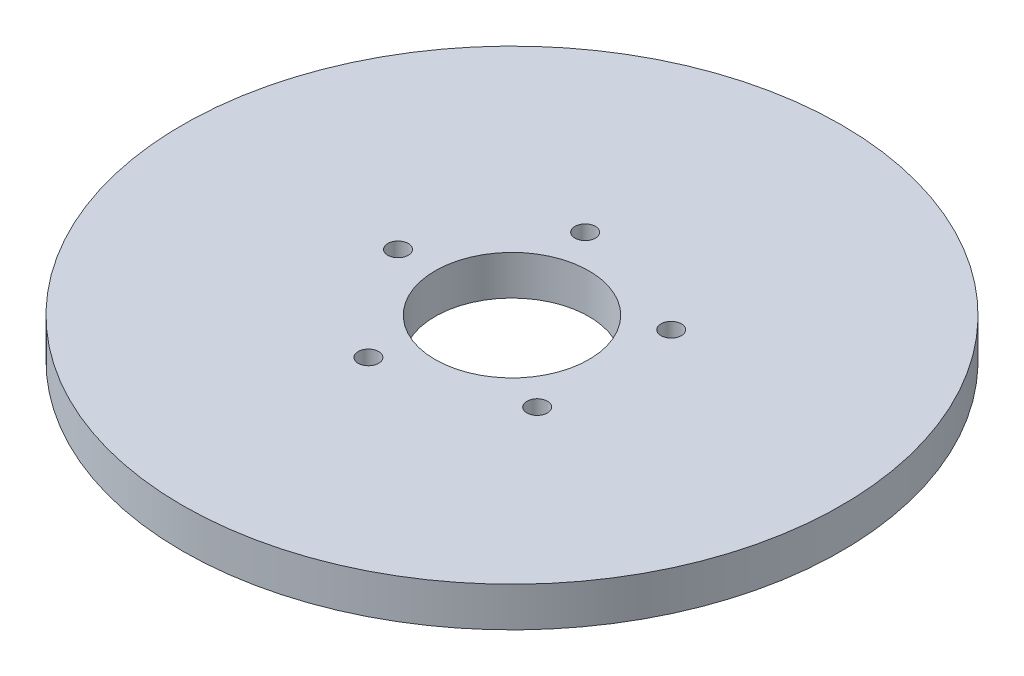
ISO-10303-21;
HEADER;
FILE_DESCRIPTION(('STEP AP214'),'2;1');
FILE_NAME('part.step','',(''),(''),'','','');
FILE_SCHEMA(('AUTOMOTIVE_DESIGN { 1 0 10303 214 1 1 1 1 }'));
ENDSEC;
DATA;
#1=APPLICATION_CONTEXT('core data for automotive mechanical design processes');
#2=APPLICATION_PROTOCOL_DEFINITION('international standard','automotive_design',2000,#1);
#3=PRODUCT_CONTEXT('',#1,'mechanical');
#4=PRODUCT('Part','Part','',(#3));
#5=PRODUCT_RELATED_PRODUCT_CATEGORY('part','',(#4));
#6=PRODUCT_DEFINITION_FORMATION('','',#4);
#7=PRODUCT_DEFINITION_CONTEXT('part definition',#1,'design');
#8=PRODUCT_DEFINITION('design','',#6,#7);
#9=PRODUCT_DEFINITION_SHAPE('','',#8);
#10=(LENGTH_UNIT() NAMED_UNIT(*) SI_UNIT(.MILLI.,.METRE.));
#11=(NAMED_UNIT(*) PLANE_ANGLE_UNIT() SI_UNIT($,.RADIAN.));
#12=(NAMED_UNIT(*) SI_UNIT($,.STERADIAN.) SOLID_ANGLE_UNIT());
#13=UNCERTAINTY_MEASURE_WITH_UNIT(LENGTH_MEASURE(1.E-05),#10,'distance_accuracy_value','');
#14=(GEOMETRIC_REPRESENTATION_CONTEXT(3) GLOBAL_UNCERTAINTY_ASSIGNED_CONTEXT((#13)) GLOBAL_UNIT_ASSIGNED_CONTEXT((#10,
#11,#12)) REPRESENTATION_CONTEXT('',''));
#15=CARTESIAN_POINT('',(0.,0.,0.));
#16=DIRECTION('',(0.,0.,1.));
#17=DIRECTION('',(1.,0.,0.));
#18=AXIS2_PLACEMENT_3D('',#15,#16,#17);
#19=CARTESIAN_POINT('',(0.,9.,0.));
#20=DIRECTION('',(0.,-1.,0.));
#21=DIRECTION('',(0.,0.,-1.));
#22=AXIS2_PLACEMENT_3D('',#19,#20,#21);
#23=CYLINDRICAL_SURFACE('',#22,75.);
#24=CARTESIAN_POINT('',(0.,9.,0.));
#25=DIRECTION('',(0.,1.,0.));
#26=DIRECTION('',(0.,0.,1.));
#27=AXIS2_PLACEMENT_3D('',#24,#25,#26);
#28=CIRCLE('',#27,75.);
#29=CARTESIAN_POINT('',(0.,9.,75.));
#30=VERTEX_POINT('',#29);
#31=EDGE_CURVE('E10',#30,#30,#28,.T.);
#32=ORIENTED_EDGE('',*,*,#31,.F.);
#33=EDGE_LOOP('',(#32));
#34=FACE_BOUND('',#33,.T.);
#35=CARTESIAN_POINT('',(0.,0.,0.));
#36=DIRECTION('',(0.,1.,0.));
#37=DIRECTION('',(0.,0.,1.));
#38=AXIS2_PLACEMENT_3D('',#35,#36,#37);
#39=CIRCLE('',#38,75.);
#40=CARTESIAN_POINT('',(0.,0.,75.));
#41=VERTEX_POINT('',#40);
#42=EDGE_CURVE('E37',#41,#41,#39,.T.);
#43=ORIENTED_EDGE('',*,*,#42,.T.);
#44=EDGE_LOOP('',(#43));
#45=FACE_BOUND('',#44,.T.);
#46=ADVANCED_FACE('F40',(#34,#45),#23,.T.);
#47=CARTESIAN_POINT('',(0.,9.,0.));
#48=DIRECTION('',(0.,1.,0.));
#49=DIRECTION('',(0.,0.,1.));
#50=AXIS2_PLACEMENT_3D('',#47,#48,#49);
#51=PLANE('',#50);
#52=CARTESIAN_POINT('',(-8.01522008981041,9.,24.6683109172461));
#53=DIRECTION('',(0.,1.,0.));
#54=DIRECTION('',(0.951056516295155,0.,0.309016994374945));
#55=AXIS2_PLACEMENT_3D('',#52,#53,#54);
#56=CIRCLE('',#55,2.33240991265965);
#57=CARTESIAN_POINT('',(-5.79696644370404,9.,25.3890652181065));
#58=VERTEX_POINT('',#57);
#59=EDGE_CURVE('E78',#58,#58,#56,.T.);
#60=ORIENTED_EDGE('',*,*,#59,.F.);
#61=EDGE_LOOP('',(#60));
#62=FACE_BOUND('',#61,.T.);
#63=CARTESIAN_POINT('',(20.9841186224349,9.,15.2458545919081));
#64=DIRECTION('',(0.,1.,0.));
#65=DIRECTION('',(0.587785252292469,0.,-0.809016994374951));
#66=AXIS2_PLACEMENT_3D('',#63,#64,#65);
#67=CIRCLE('',#66,2.33240991265965);
#68=CARTESIAN_POINT('',(22.355074771397,9.,13.3588953347178));
#69=VERTEX_POINT('',#68);
#70=EDGE_CURVE('E71',#69,#69,#67,.T.);
#71=ORIENTED_EDGE('',*,*,#70,.F.);
#72=EDGE_LOOP('',(#71));
#73=FACE_BOUND('',#72,.T.);
#74=CARTESIAN_POINT('',(20.9841186224347,9.,-15.2458545919084));
#75=DIRECTION('',(0.,1.,0.));
#76=DIRECTION('',(-0.58778525229248,0.,-0.809016994374942));
#77=AXIS2_PLACEMENT_3D('',#74,#75,#76);
#78=CIRCLE('',#77,2.33240991265965);
#79=CARTESIAN_POINT('',(19.6131624734726,9.,-17.1328138490986));
#80=VERTEX_POINT('',#79);
#81=EDGE_CURVE('E70',#80,#80,#78,.T.);
#82=ORIENTED_EDGE('',*,*,#81,.F.);
#83=EDGE_LOOP('',(#82));
#84=FACE_BOUND('',#83,.T.);
#85=CARTESIAN_POINT('',(-8.01522008981076,9.,-24.668310917246));
#86=DIRECTION('',(0.,1.,0.));
#87=DIRECTION('',(-0.95105651629515,0.,0.309016994374958));
#88=AXIS2_PLACEMENT_3D('',#85,#86,#87);
#89=CIRCLE('',#88,2.33240991265965);
#90=CARTESIAN_POINT('',(-10.2334737359171,9.,-23.9475566163855));
#91=VERTEX_POINT('',#90);
#92=EDGE_CURVE('E61',#91,#91,#89,.T.);
#93=ORIENTED_EDGE('',*,*,#92,.F.);
#94=EDGE_LOOP('',(#93));
#95=FACE_BOUND('',#94,.T.);
#96=CARTESIAN_POINT('',(-25.9377970652487,9.,0.));
#97=DIRECTION('',(0.,1.,0.));
#98=DIRECTION('',(0.,0.,1.));
#99=AXIS2_PLACEMENT_3D('',#96,#97,#98);
#100=CIRCLE('',#99,2.33240991265965);
#101=CARTESIAN_POINT('',(-25.9377970652487,9.,2.33240991265965));
#102=VERTEX_POINT('',#101);
#103=EDGE_CURVE('E54',#102,#102,#100,.T.);
#104=ORIENTED_EDGE('',*,*,#103,.F.);
#105=EDGE_LOOP('',(#104));
#106=FACE_BOUND('',#105,.T.);
#107=CARTESIAN_POINT('',(0.,9.,0.));
#108=DIRECTION('',(0.,1.,0.));
#109=DIRECTION('',(0.,0.,1.));
#110=AXIS2_PLACEMENT_3D('',#107,#108,#109);
#111=CIRCLE('',#110,17.5);
#112=CARTESIAN_POINT('',(0.,9.,17.5));
#113=VERTEX_POINT('',#112);
#114=EDGE_CURVE('E50',#113,#113,#111,.T.);
#115=ORIENTED_EDGE('',*,*,#114,.F.);
#116=EDGE_LOOP('',(#115));
#117=FACE_BOUND('',#116,.T.);
#118=ORIENTED_EDGE('',*,*,#31,.T.);
#119=EDGE_LOOP('',(#118));
#120=FACE_BOUND('',#119,.T.);
#121=ADVANCED_FACE('F94',(#62,#73,#84,#95,#106,#117,#120),#51,.T.);
#122=CARTESIAN_POINT('',(0.,0.,0.));
#123=DIRECTION('',(0.,1.,0.));
#124=DIRECTION('',(0.,0.,1.));
#125=AXIS2_PLACEMENT_3D('',#122,#123,#124);
#126=PLANE('',#125);
#127=CARTESIAN_POINT('',(0.,0.,0.));
#128=DIRECTION('',(0.,1.,0.));
#129=DIRECTION('',(0.,0.,1.));
#130=AXIS2_PLACEMENT_3D('',#127,#128,#129);
#131=CIRCLE('',#130,17.5);
#132=CARTESIAN_POINT('',(0.,0.,17.5));
#133=VERTEX_POINT('',#132);
#134=EDGE_CURVE('E47',#133,#133,#131,.T.);
#135=ORIENTED_EDGE('',*,*,#134,.T.);
#136=EDGE_LOOP('',(#135));
#137=FACE_BOUND('',#136,.T.);
#138=ORIENTED_EDGE('',*,*,#42,.F.);
#139=EDGE_LOOP('',(#138));
#140=FACE_BOUND('',#139,.T.);
#141=ADVANCED_FACE('F100',(#137,#140),#126,.F.);
#142=CARTESIAN_POINT('',(0.,9.,0.));
#143=DIRECTION('',(0.,-1.,0.));
#144=DIRECTION('',(0.,0.,-1.));
#145=AXIS2_PLACEMENT_3D('',#142,#143,#144);
#146=CYLINDRICAL_SURFACE('',#145,17.5);
#147=ORIENTED_EDGE('',*,*,#114,.T.);
#148=EDGE_LOOP('',(#147));
#149=FACE_BOUND('',#148,.T.);
#150=ORIENTED_EDGE('',*,*,#134,.F.);
#151=EDGE_LOOP('',(#150));
#152=FACE_BOUND('',#151,.T.);
#153=ADVANCED_FACE('F108',(#149,#152),#146,.F.);
#154=CARTESIAN_POINT('',(-25.9377970652487,0.433587434508758,0.));
#155=DIRECTION('',(0.,1.,0.));
#156=DIRECTION('',(0.,0.,1.));
#157=AXIS2_PLACEMENT_3D('',#154,#155,#156);
#158=CYLINDRICAL_SURFACE('',#157,2.33240991265965);
#159=CARTESIAN_POINT('',(-25.9377970652487,0.433587434508758,0.));
#160=DIRECTION('',(0.,1.,0.));
#161=DIRECTION('',(0.,0.,1.));
#162=AXIS2_PLACEMENT_3D('',#159,#160,#161);
#163=CIRCLE('',#162,2.33240991265965);
#164=CARTESIAN_POINT('',(-25.9377970652487,0.433587434508758,2.33240991265965));
#165=VERTEX_POINT('',#164);
#166=EDGE_CURVE('E55',#165,#165,#163,.T.);
#167=ORIENTED_EDGE('',*,*,#166,.F.);
#168=EDGE_LOOP('',(#167));
#169=FACE_BOUND('',#168,.T.);
#170=ORIENTED_EDGE('',*,*,#103,.T.);
#171=EDGE_LOOP('',(#170));
#172=FACE_BOUND('',#171,.T.);
#173=ADVANCED_FACE('F115',(#169,#172),#158,.F.);
#174=CARTESIAN_POINT('',(-25.9377970652487,0.433587434508758,0.));
#175=DIRECTION('',(0.,1.,0.));
#176=DIRECTION('',(0.,0.,1.));
#177=AXIS2_PLACEMENT_3D('',#174,#175,#176);
#178=PLANE('',#177);
#179=ORIENTED_EDGE('',*,*,#166,.T.);
#180=EDGE_LOOP('',(#179));
#181=FACE_BOUND('',#180,.T.);
#182=ADVANCED_FACE('F142',(#181),#178,.T.);
#183=CARTESIAN_POINT('',(-8.01522008981076,0.433587434508758,-24.668310917246));
#184=DIRECTION('',(0.,1.,0.));
#185=DIRECTION('',(0.,0.,1.));
#186=AXIS2_PLACEMENT_3D('',#183,#184,#185);
#187=CYLINDRICAL_SURFACE('',#186,2.33240991265965);
#188=CARTESIAN_POINT('',(-8.01522008981076,0.433587434508758,-24.668310917246));
#189=DIRECTION('',(0.,1.,0.));
#190=DIRECTION('',(-0.95105651629515,0.,0.309016994374958));
#191=AXIS2_PLACEMENT_3D('',#188,#189,#190);
#192=CIRCLE('',#191,2.33240991265965);
#193=CARTESIAN_POINT('',(-10.2334737359171,0.433587434508758,-23.9475566163855));
#194=VERTEX_POINT('',#193);
#195=EDGE_CURVE('E63',#194,#194,#192,.T.);
#196=ORIENTED_EDGE('',*,*,#195,.F.);
#197=EDGE_LOOP('',(#196));
#198=FACE_BOUND('',#197,.T.);
#199=ORIENTED_EDGE('',*,*,#92,.T.);
#200=EDGE_LOOP('',(#199));
#201=FACE_BOUND('',#200,.T.);
#202=ADVANCED_FACE('F147',(#198,#201),#187,.F.);
#203=CARTESIAN_POINT('',(-8.01522008981076,0.433587434508758,-24.668310917246));
#204=DIRECTION('',(0.,1.,0.));
#205=DIRECTION('',(-0.95105651629515,0.,0.309016994374958));
#206=AXIS2_PLACEMENT_3D('',#203,#204,#205);
#207=PLANE('',#206);
#208=ORIENTED_EDGE('',*,*,#195,.T.);
#209=EDGE_LOOP('',(#208));
#210=FACE_BOUND('',#209,.T.);
#211=ADVANCED_FACE('F163',(#210),#207,.T.);
#212=CARTESIAN_POINT('',(20.9841186224347,0.433587434508758,-15.2458545919084));
#213=DIRECTION('',(0.,1.,0.));
#214=DIRECTION('',(0.,0.,1.));
#215=AXIS2_PLACEMENT_3D('',#212,#213,#214);
#216=CYLINDRICAL_SURFACE('',#215,2.33240991265965);
#217=CARTESIAN_POINT('',(20.9841186224347,0.433587434508758,-15.2458545919084));
#218=DIRECTION('',(0.,1.,0.));
#219=DIRECTION('',(-0.58778525229248,0.,-0.809016994374942));
#220=AXIS2_PLACEMENT_3D('',#217,#218,#219);
#221=CIRCLE('',#220,2.33240991265965);
#222=CARTESIAN_POINT('',(19.6131624734726,0.433587434508758,-17.1328138490986));
#223=VERTEX_POINT('',#222);
#224=EDGE_CURVE('E69',#223,#223,#221,.T.);
#225=ORIENTED_EDGE('',*,*,#224,.F.);
#226=EDGE_LOOP('',(#225));
#227=FACE_BOUND('',#226,.T.);
#228=ORIENTED_EDGE('',*,*,#81,.T.);
#229=EDGE_LOOP('',(#228));
#230=FACE_BOUND('',#229,.T.);
#231=ADVANCED_FACE('F172',(#227,#230),#216,.F.);
#232=CARTESIAN_POINT('',(20.9841186224347,0.433587434508758,-15.2458545919084));
#233=DIRECTION('',(0.,1.,0.));
#234=DIRECTION('',(-0.58778525229248,0.,-0.809016994374942));
#235=AXIS2_PLACEMENT_3D('',#232,#233,#234);
#236=PLANE('',#235);
#237=ORIENTED_EDGE('',*,*,#224,.T.);
#238=EDGE_LOOP('',(#237));
#239=FACE_BOUND('',#238,.T.);
#240=ADVANCED_FACE('F185',(#239),#236,.T.);
#241=CARTESIAN_POINT('',(20.9841186224349,0.433587434508758,15.2458545919081));
#242=DIRECTION('',(0.,1.,0.));
#243=DIRECTION('',(0.,0.,1.));
#244=AXIS2_PLACEMENT_3D('',#241,#242,#243);
#245=CYLINDRICAL_SURFACE('',#244,2.33240991265965);
#246=CARTESIAN_POINT('',(20.9841186224349,0.433587434508758,15.2458545919081));
#247=DIRECTION('',(0.,1.,0.));
#248=DIRECTION('',(0.587785252292469,0.,-0.809016994374951));
#249=AXIS2_PLACEMENT_3D('',#246,#247,#248);
#250=CIRCLE('',#249,2.33240991265965);
#251=CARTESIAN_POINT('',(22.355074771397,0.433587434508758,13.3588953347178));
#252=VERTEX_POINT('',#251);
#253=EDGE_CURVE('E76',#252,#252,#250,.T.);
#254=ORIENTED_EDGE('',*,*,#253,.F.);
#255=EDGE_LOOP('',(#254));
#256=FACE_BOUND('',#255,.T.);
#257=ORIENTED_EDGE('',*,*,#70,.T.);
#258=EDGE_LOOP('',(#257));
#259=FACE_BOUND('',#258,.T.);
#260=ADVANCED_FACE('F191',(#256,#259),#245,.F.);
#261=CARTESIAN_POINT('',(20.9841186224349,0.433587434508758,15.2458545919081));
#262=DIRECTION('',(0.,1.,0.));
#263=DIRECTION('',(0.587785252292469,0.,-0.809016994374951));
#264=AXIS2_PLACEMENT_3D('',#261,#262,#263);
#265=PLANE('',#264);
#266=ORIENTED_EDGE('',*,*,#253,.T.);
#267=EDGE_LOOP('',(#266));
#268=FACE_BOUND('',#267,.T.);
#269=ADVANCED_FACE('F89',(#268),#265,.T.);
#270=CARTESIAN_POINT('',(-8.01522008981041,0.433587434508758,24.6683109172461));
#271=DIRECTION('',(0.,1.,0.));
#272=DIRECTION('',(0.,0.,1.));
#273=AXIS2_PLACEMENT_3D('',#270,#271,#272);
#274=CYLINDRICAL_SURFACE('',#273,2.33240991265965);
#275=CARTESIAN_POINT('',(-8.01522008981041,0.433587434508758,24.6683109172461));
#276=DIRECTION('',(0.,1.,0.));
#277=DIRECTION('',(0.951056516295155,0.,0.309016994374945));
#278=AXIS2_PLACEMENT_3D('',#275,#276,#277);
#279=CIRCLE('',#278,2.33240991265965);
#280=CARTESIAN_POINT('',(-5.79696644370404,0.433587434508758,25.3890652181065));
#281=VERTEX_POINT('',#280);
#282=EDGE_CURVE('E59',#281,#281,#279,.T.);
#283=ORIENTED_EDGE('',*,*,#282,.F.);
#284=EDGE_LOOP('',(#283));
#285=FACE_BOUND('',#284,.T.);
#286=ORIENTED_EDGE('',*,*,#59,.T.);
#287=EDGE_LOOP('',(#286));
#288=FACE_BOUND('',#287,.T.);
#289=ADVANCED_FACE('F87',(#285,#288),#274,.F.);
#290=CARTESIAN_POINT('',(-8.01522008981041,0.433587434508758,24.6683109172461));
#291=DIRECTION('',(0.,1.,0.));
#292=DIRECTION('',(0.951056516295155,0.,0.309016994374945));
#293=AXIS2_PLACEMENT_3D('',#290,#291,#292);
#294=PLANE('',#293);
#295=ORIENTED_EDGE('',*,*,#282,.T.);
#296=EDGE_LOOP('',(#295));
#297=FACE_BOUND('',#296,.T.);
#298=ADVANCED_FACE('F84',(#297),#294,.T.);
#299=CLOSED_SHELL('',(#46,#121,#141,#153,#173,#182,#202,#211,#231,#240,#260,#269,#289,#298));
#300=MANIFOLD_SOLID_BREP('B2',#299);
#301=ADVANCED_BREP_SHAPE_REPRESENTATION('',(#18,#300),#14);
#302=SHAPE_DEFINITION_REPRESENTATION(#9,#301);
ENDSEC;
END-ISO-10303-21;
